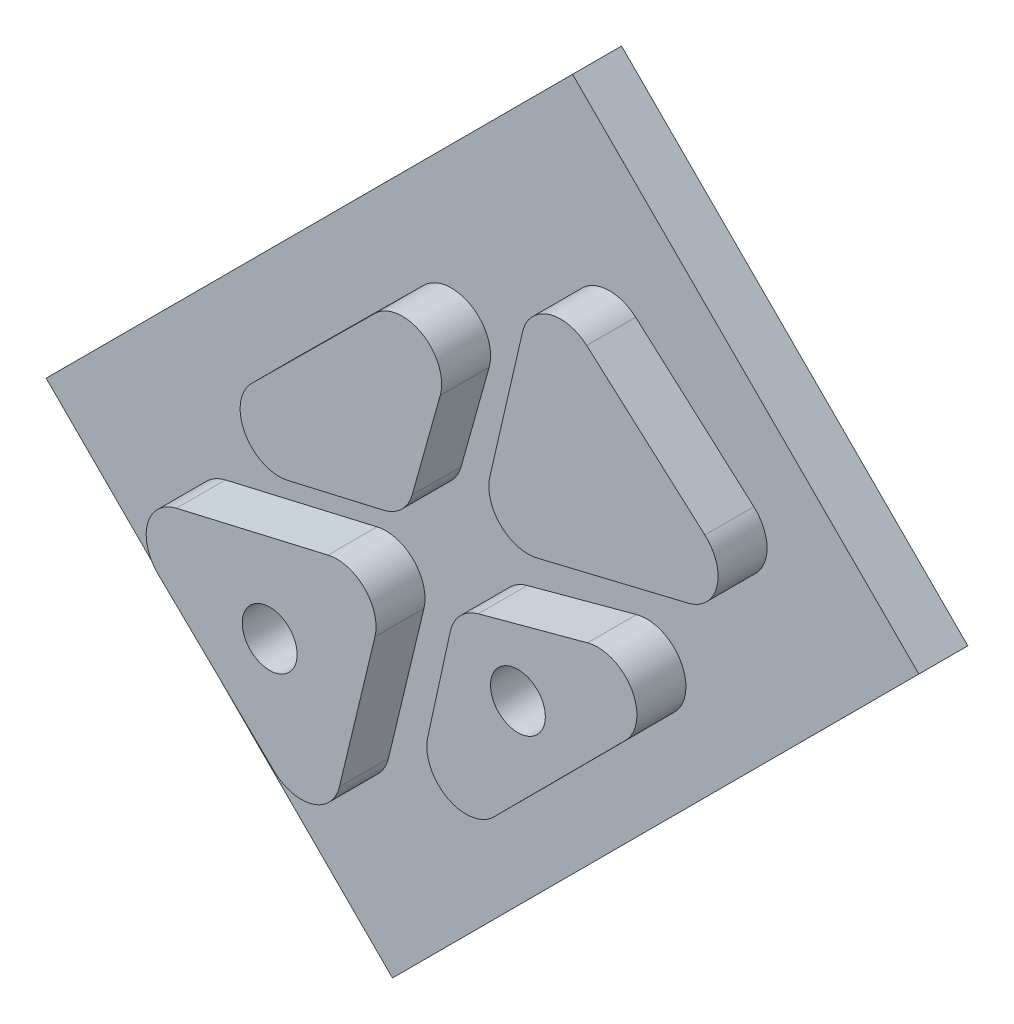
ISO-10303-21;
HEADER;
FILE_DESCRIPTION(('STEP AP214'),'2;1');
FILE_NAME('part.step','',(''),(''),'','','');
FILE_SCHEMA(('AUTOMOTIVE_DESIGN { 1 0 10303 214 1 1 1 1 }'));
ENDSEC;
DATA;
#1=APPLICATION_CONTEXT('core data for automotive mechanical design processes');
#2=APPLICATION_PROTOCOL_DEFINITION('international standard','automotive_design',2000,#1);
#3=PRODUCT_CONTEXT('',#1,'mechanical');
#4=PRODUCT('Part','Part','',(#3));
#5=PRODUCT_RELATED_PRODUCT_CATEGORY('part','',(#4));
#6=PRODUCT_DEFINITION_FORMATION('','',#4);
#7=PRODUCT_DEFINITION_CONTEXT('part definition',#1,'design');
#8=PRODUCT_DEFINITION('design','',#6,#7);
#9=PRODUCT_DEFINITION_SHAPE('','',#8);
#10=(LENGTH_UNIT() NAMED_UNIT(*) SI_UNIT(.MILLI.,.METRE.));
#11=(NAMED_UNIT(*) PLANE_ANGLE_UNIT() SI_UNIT($,.RADIAN.));
#12=(NAMED_UNIT(*) SI_UNIT($,.STERADIAN.) SOLID_ANGLE_UNIT());
#13=UNCERTAINTY_MEASURE_WITH_UNIT(LENGTH_MEASURE(1.E-05),#10,'distance_accuracy_value','');
#14=(GEOMETRIC_REPRESENTATION_CONTEXT(3) GLOBAL_UNCERTAINTY_ASSIGNED_CONTEXT((#13)) GLOBAL_UNIT_ASSIGNED_CONTEXT((#10,
#11,#12)) REPRESENTATION_CONTEXT('',''));
#15=CARTESIAN_POINT('',(0.,0.,0.));
#16=DIRECTION('',(0.,0.,1.));
#17=DIRECTION('',(1.,0.,0.));
#18=AXIS2_PLACEMENT_3D('',#15,#16,#17);
#19=CARTESIAN_POINT('',(232.187566849843,-300.437513369969,6.35));
#20=DIRECTION('',(0.707106781186548,0.707106781186547,0.));
#21=DIRECTION('',(-0.707106781186547,0.707106781186548,0.));
#22=AXIS2_PLACEMENT_3D('',#19,#20,#21);
#23=PLANE('',#22);
#24=DIRECTION('',(0.707106781186547,-0.707106781186548,0.));
#25=VECTOR('',#24,1.);
#26=CARTESIAN_POINT('',(232.187566849843,-300.437513369969,0.));
#27=LINE('',#26,#25);
#28=CARTESIAN_POINT('',(187.286286244497,-255.536232764624,0.));
#29=VERTEX_POINT('',#28);
#30=CARTESIAN_POINT('',(232.187566849843,-300.437513369969,0.));
#31=VERTEX_POINT('',#30);
#32=EDGE_CURVE('E359',#29,#31,#27,.T.);
#33=ORIENTED_EDGE('',*,*,#32,.T.);
#34=DIRECTION('',(0.,0.,-1.));
#35=VECTOR('',#34,1.);
#36=CARTESIAN_POINT('',(232.187566849843,-300.437513369969,6.35));
#37=LINE('',#36,#35);
#38=CARTESIAN_POINT('',(232.187566849843,-300.437513369969,6.35));
#39=VERTEX_POINT('',#38);
#40=EDGE_CURVE('E340',#39,#31,#37,.T.);
#41=ORIENTED_EDGE('',*,*,#40,.F.);
#42=DIRECTION('',(0.707106781186547,-0.707106781186548,0.));
#43=VECTOR('',#42,1.);
#44=CARTESIAN_POINT('',(232.187566849843,-300.437513369969,6.35));
#45=LINE('',#44,#43);
#46=CARTESIAN_POINT('',(187.286286244497,-255.536232764624,6.35));
#47=VERTEX_POINT('',#46);
#48=EDGE_CURVE('E347',#47,#39,#45,.T.);
#49=ORIENTED_EDGE('',*,*,#48,.F.);
#50=DIRECTION('',(0.,0.,-1.));
#51=VECTOR('',#50,1.);
#52=CARTESIAN_POINT('',(187.286286244497,-255.536232764624,6.35));
#53=LINE('',#52,#51);
#54=EDGE_CURVE('E554',#47,#29,#53,.T.);
#55=ORIENTED_EDGE('',*,*,#54,.T.);
#56=EDGE_LOOP('',(#33,#41,#49,#55));
#57=FACE_BOUND('',#56,.T.);
#58=ADVANCED_FACE('F150',(#57),#23,.F.);
#59=CARTESIAN_POINT('',(300.437513369968,-232.187566849844,6.35));
#60=DIRECTION('',(-0.707106781186548,0.707106781186548,0.));
#61=DIRECTION('',(-0.707106781186548,-0.707106781186548,0.));
#62=AXIS2_PLACEMENT_3D('',#59,#60,#61);
#63=PLANE('',#62);
#64=DIRECTION('',(0.707106781186547,0.707106781186547,0.));
#65=VECTOR('',#64,1.);
#66=CARTESIAN_POINT('',(300.437513369968,-232.187566849844,0.));
#67=LINE('',#66,#65);
#68=CARTESIAN_POINT('',(300.437513369968,-232.187566849844,0.));
#69=VERTEX_POINT('',#68);
#70=EDGE_CURVE('E556',#31,#69,#67,.T.);
#71=ORIENTED_EDGE('',*,*,#70,.T.);
#72=DIRECTION('',(0.,0.,-1.));
#73=VECTOR('',#72,1.);
#74=CARTESIAN_POINT('',(300.437513369968,-232.187566849844,6.35));
#75=LINE('',#74,#73);
#76=CARTESIAN_POINT('',(300.437513369968,-232.187566849844,6.35));
#77=VERTEX_POINT('',#76);
#78=EDGE_CURVE('E343',#77,#69,#75,.T.);
#79=ORIENTED_EDGE('',*,*,#78,.F.);
#80=DIRECTION('',(0.707106781186547,0.707106781186547,0.));
#81=VECTOR('',#80,1.);
#82=CARTESIAN_POINT('',(300.437513369968,-232.187566849844,6.35));
#83=LINE('',#82,#81);
#84=EDGE_CURVE('E336',#39,#77,#83,.T.);
#85=ORIENTED_EDGE('',*,*,#84,.F.);
#86=ORIENTED_EDGE('',*,*,#40,.T.);
#87=EDGE_LOOP('',(#71,#79,#85,#86));
#88=FACE_BOUND('',#87,.T.);
#89=ADVANCED_FACE('F338',(#88),#63,.F.);
#90=CARTESIAN_POINT('',(255.536232764623,-187.286286244498,6.35));
#91=DIRECTION('',(-0.707106781186547,-0.707106781186548,0.));
#92=DIRECTION('',(0.707106781186548,-0.707106781186547,0.));
#93=AXIS2_PLACEMENT_3D('',#90,#91,#92);
#94=PLANE('',#93);
#95=DIRECTION('',(-0.707106781186548,0.707106781186547,0.));
#96=VECTOR('',#95,1.);
#97=CARTESIAN_POINT('',(255.536232764623,-187.286286244498,0.));
#98=LINE('',#97,#96);
#99=CARTESIAN_POINT('',(255.536232764623,-187.286286244498,0.));
#100=VERTEX_POINT('',#99);
#101=EDGE_CURVE('E558',#69,#100,#98,.T.);
#102=ORIENTED_EDGE('',*,*,#101,.T.);
#103=DIRECTION('',(0.,0.,-1.));
#104=VECTOR('',#103,1.);
#105=CARTESIAN_POINT('',(255.536232764623,-187.286286244498,6.35));
#106=LINE('',#105,#104);
#107=CARTESIAN_POINT('',(255.536232764623,-187.286286244498,6.35));
#108=VERTEX_POINT('',#107);
#109=EDGE_CURVE('E364',#108,#100,#106,.T.);
#110=ORIENTED_EDGE('',*,*,#109,.F.);
#111=DIRECTION('',(-0.707106781186548,0.707106781186547,0.));
#112=VECTOR('',#111,1.);
#113=CARTESIAN_POINT('',(255.536232764623,-187.286286244498,6.35));
#114=LINE('',#113,#112);
#115=EDGE_CURVE('E346',#77,#108,#114,.T.);
#116=ORIENTED_EDGE('',*,*,#115,.F.);
#117=ORIENTED_EDGE('',*,*,#78,.T.);
#118=EDGE_LOOP('',(#102,#110,#116,#117));
#119=FACE_BOUND('',#118,.T.);
#120=ADVANCED_FACE('F570',(#119),#94,.F.);
#121=CARTESIAN_POINT('',(187.286286244497,-255.536232764624,6.35));
#122=DIRECTION('',(0.707106781186548,-0.707106781186548,0.));
#123=DIRECTION('',(0.707106781186548,0.707106781186548,0.));
#124=AXIS2_PLACEMENT_3D('',#121,#122,#123);
#125=PLANE('',#124);
#126=DIRECTION('',(-0.707106781186547,-0.707106781186547,0.));
#127=VECTOR('',#126,1.);
#128=CARTESIAN_POINT('',(187.286286244497,-255.536232764624,0.));
#129=LINE('',#128,#127);
#130=EDGE_CURVE('E356',#100,#29,#129,.T.);
#131=ORIENTED_EDGE('',*,*,#130,.T.);
#132=ORIENTED_EDGE('',*,*,#54,.F.);
#133=DIRECTION('',(-0.707106781186547,-0.707106781186547,0.));
#134=VECTOR('',#133,1.);
#135=CARTESIAN_POINT('',(187.286286244497,-255.536232764624,6.35));
#136=LINE('',#135,#134);
#137=EDGE_CURVE('E352',#108,#47,#136,.T.);
#138=ORIENTED_EDGE('',*,*,#137,.F.);
#139=ORIENTED_EDGE('',*,*,#109,.T.);
#140=EDGE_LOOP('',(#131,#132,#138,#139));
#141=FACE_BOUND('',#140,.T.);
#142=ADVANCED_FACE('F565',(#141),#125,.F.);
#143=CARTESIAN_POINT('',(0.,0.,6.35));
#144=DIRECTION('',(0.,0.,-1.));
#145=DIRECTION('',(-1.,0.,0.));
#146=AXIS2_PLACEMENT_3D('',#143,#144,#145);
#147=PLANE('',#146);
#148=DIRECTION('',(0.710263211480383,0.703936197689516,0.));
#149=VECTOR('',#148,1.);
#150=CARTESIAN_POINT('',(227.372114401296,-229.415746350039,6.35));
#151=LINE('',#150,#149);
#152=CARTESIAN_POINT('',(220.290147249652,-236.43462744695,6.35));
#153=VERTEX_POINT('',#152);
#154=CARTESIAN_POINT('',(236.257974943894,-220.609040916826,6.35));
#155=VERTEX_POINT('',#154);
#156=EDGE_CURVE('E495',#153,#155,#151,.T.);
#157=ORIENTED_EDGE('',*,*,#156,.T.);
#158=CARTESIAN_POINT('',(239.833970828157,-224.217178031146,6.35));
#159=DIRECTION('',(0.,0.,-1.));
#160=DIRECTION('',(-1.,0.,0.));
#161=AXIS2_PLACEMENT_3D('',#158,#159,#160);
#162=CIRCLE('',#161,5.08);
#163=CARTESIAN_POINT('',(244.725964113775,-225.586412011687,6.35));
#164=VERTEX_POINT('',#163);
#165=EDGE_CURVE('E450',#155,#164,#162,.T.);
#166=ORIENTED_EDGE('',*,*,#165,.T.);
#167=DIRECTION('',(-0.269534248137939,-0.962990804255532,0.));
#168=VECTOR('',#167,1.);
#169=CARTESIAN_POINT('',(285.499922346645,-79.9093891375555,6.35));
#170=LINE('',#169,#168);
#171=CARTESIAN_POINT('',(241.092359992385,-238.56853721239,6.35));
#172=VERTEX_POINT('',#171);
#173=EDGE_CURVE('E474',#164,#172,#170,.T.);
#174=ORIENTED_EDGE('',*,*,#173,.T.);
#175=CARTESIAN_POINT('',(236.200366706767,-237.199303231849,6.35));
#176=DIRECTION('',(0.,0.,-1.));
#177=DIRECTION('',(-1.,0.,0.));
#178=AXIS2_PLACEMENT_3D('',#175,#176,#177);
#179=CIRCLE('',#178,5.08);
#180=CARTESIAN_POINT('',(237.341548725504,-242.149465209008,6.35));
#181=VERTEX_POINT('',#180);
#182=EDGE_CURVE('E12',#172,#181,#179,.T.);
#183=ORIENTED_EDGE('',*,*,#182,.T.);
#184=DIRECTION('',(0.974441334086424,0.224642129672663,0.));
#185=VECTOR('',#184,1.);
#186=CARTESIAN_POINT('',(64.9838819676013,-281.883815519801,6.35));
#187=LINE('',#186,#185);
#188=CARTESIAN_POINT('',(225.007325152651,-244.992926538429,6.35));
#189=VERTEX_POINT('',#188);
#190=EDGE_CURVE('E487',#189,#181,#187,.T.);
#191=ORIENTED_EDGE('',*,*,#190,.F.);
#192=CARTESIAN_POINT('',(223.866143133914,-240.04276456127,6.35));
#193=DIRECTION('',(0.,0.,-1.));
#194=DIRECTION('',(-1.,0.,0.));
#195=AXIS2_PLACEMENT_3D('',#192,#193,#194);
#196=CIRCLE('',#195,5.08);
#197=EDGE_CURVE('E159',#189,#153,#196,.T.);
#198=ORIENTED_EDGE('',*,*,#197,.T.);
#199=EDGE_LOOP('',(#157,#166,#174,#183,#191,#198));
#200=FACE_BOUND('',#199,.T.);
#201=DIRECTION('',(-0.224752967151728,-0.974415775609413,0.));
#202=VECTOR('',#201,1.);
#203=CARTESIAN_POINT('',(289.171164271793,-66.6985067479623,6.35));
#204=LINE('',#203,#202);
#205=CARTESIAN_POINT('',(255.395669608826,-213.132056639157,6.35));
#206=VERTEX_POINT('',#205);
#207=CARTESIAN_POINT('',(251.165866137332,-231.470356162336,6.35));
#208=VERTEX_POINT('',#207);
#209=EDGE_CURVE('E493',#206,#208,#204,.T.);
#210=ORIENTED_EDGE('',*,*,#209,.F.);
#211=CARTESIAN_POINT('',(260.345701748922,-214.273801712288,6.35));
#212=DIRECTION('',(0.,0.,-1.));
#213=DIRECTION('',(-1.,0.,0.));
#214=AXIS2_PLACEMENT_3D('',#211,#212,#213);
#215=CIRCLE('',#214,5.08);
#216=CARTESIAN_POINT('',(263.719766841166,-210.476159713192,6.35));
#217=VERTEX_POINT('',#216);
#218=EDGE_CURVE('E452',#206,#217,#215,.T.);
#219=ORIENTED_EDGE('',*,*,#218,.T.);
#220=DIRECTION('',(-0.747567322656667,0.664186041780421,0.));
#221=VECTOR('',#220,1.);
#222=CARTESIAN_POINT('',(11.8317363423572,13.3170812143621,6.35));
#223=LINE('',#222,#221);
#224=CARTESIAN_POINT('',(279.046980021704,-224.093824297204,6.35));
#225=VERTEX_POINT('',#224);
#226=EDGE_CURVE('E503',#225,#217,#223,.T.);
#227=ORIENTED_EDGE('',*,*,#226,.F.);
#228=CARTESIAN_POINT('',(275.67291492946,-227.8914662963,6.35));
#229=DIRECTION('',(0.,0.,-1.));
#230=DIRECTION('',(-1.,0.,0.));
#231=AXIS2_PLACEMENT_3D('',#228,#229,#230);
#232=CIRCLE('',#231,5.08);
#233=CARTESIAN_POINT('',(276.864883050935,-232.829645312636,6.35));
#234=VERTEX_POINT('',#233);
#235=EDGE_CURVE('E454',#225,#234,#232,.T.);
#236=ORIENTED_EDGE('',*,*,#235,.T.);
#237=DIRECTION('',(-0.972082483530827,-0.234639393991159,0.));
#238=VECTOR('',#237,1.);
#239=CARTESIAN_POINT('',(68.3488196181154,-283.160850318602,6.35));
#240=LINE('',#239,#238);
#241=CARTESIAN_POINT('',(257.307866398902,-237.550280251803,6.35));
#242=VERTEX_POINT('',#241);
#243=EDGE_CURVE('E512',#234,#242,#240,.T.);
#244=ORIENTED_EDGE('',*,*,#243,.T.);
#245=CARTESIAN_POINT('',(256.115898277427,-232.612101235466,6.35));
#246=DIRECTION('',(0.,0.,-1.));
#247=DIRECTION('',(-1.,0.,0.));
#248=AXIS2_PLACEMENT_3D('',#245,#246,#247);
#249=CIRCLE('',#248,5.08);
#250=EDGE_CURVE('E456',#242,#208,#249,.T.);
#251=ORIENTED_EDGE('',*,*,#250,.T.);
#252=EDGE_LOOP('',(#210,#219,#227,#236,#244,#251));
#253=FACE_BOUND('',#252,.T.);
#254=DIRECTION('',(-0.965499786849266,-0.260403843278134,0.));
#255=VECTOR('',#254,1.);
#256=CARTESIAN_POINT('',(79.1879448605753,-293.605282170338,6.35));
#257=LINE('',#256,#255);
#258=CARTESIAN_POINT('',(263.831735427411,-243.805216591915,6.35));
#259=VERTEX_POINT('',#258);
#260=CARTESIAN_POINT('',(249.667472252146,-247.625443813382,6.35));
#261=VERTEX_POINT('',#260);
#262=EDGE_CURVE('E530',#259,#261,#257,.T.);
#263=ORIENTED_EDGE('',*,*,#262,.F.);
#264=CARTESIAN_POINT('',(265.154586951264,-248.709955509109,6.35));
#265=DIRECTION('',(0.,0.,-1.));
#266=DIRECTION('',(-1.,0.,0.));
#267=AXIS2_PLACEMENT_3D('',#264,#265,#266);
#268=CIRCLE('',#267,5.08);
#269=CARTESIAN_POINT('',(268.752446691008,-252.296291423818,6.35));
#270=VERTEX_POINT('',#269);
#271=EDGE_CURVE('E462',#259,#270,#268,.T.);
#272=ORIENTED_EDGE('',*,*,#271,.T.);
#273=DIRECTION('',(-0.705971636753682,-0.708240106248811,0.));
#274=VECTOR('',#273,1.);
#275=CARTESIAN_POINT('',(260.954811756181,-260.118982176843,6.35));
#276=LINE('',#275,#274);
#277=CARTESIAN_POINT('',(251.672172778169,-269.431448675197,6.35));
#278=VERTEX_POINT('',#277);
#279=EDGE_CURVE('E509',#270,#278,#276,.T.);
#280=ORIENTED_EDGE('',*,*,#279,.T.);
#281=CARTESIAN_POINT('',(248.074313038425,-265.845112760488,6.35));
#282=DIRECTION('',(0.,0.,-1.));
#283=DIRECTION('',(-1.,0.,0.));
#284=AXIS2_PLACEMENT_3D('',#281,#282,#283);
#285=CIRCLE('',#284,5.08);
#286=CARTESIAN_POINT('',(243.111923277208,-264.758334099599,6.35));
#287=VERTEX_POINT('',#286);
#288=EDGE_CURVE('E458',#278,#287,#285,.T.);
#289=ORIENTED_EDGE('',*,*,#288,.T.);
#290=DIRECTION('',(0.213932807261593,0.976848378192427,0.));
#291=VECTOR('',#290,1.);
#292=CARTESIAN_POINT('',(287.314534445121,-62.922769073579,6.35));
#293=LINE('',#292,#291);
#294=CARTESIAN_POINT('',(246.027934014782,-251.443404069687,6.35));
#295=VERTEX_POINT('',#294);
#296=EDGE_CURVE('E521',#287,#295,#293,.T.);
#297=ORIENTED_EDGE('',*,*,#296,.T.);
#298=CARTESIAN_POINT('',(250.990323775999,-252.530182730576,6.35));
#299=DIRECTION('',(0.,0.,-1.));
#300=DIRECTION('',(-1.,0.,0.));
#301=AXIS2_PLACEMENT_3D('',#298,#299,#300);
#302=CIRCLE('',#301,5.08);
#303=EDGE_CURVE('E460',#295,#261,#302,.T.);
#304=ORIENTED_EDGE('',*,*,#303,.T.);
#305=EDGE_LOOP('',(#263,#272,#280,#289,#297,#304));
#306=FACE_BOUND('',#305,.T.);
#307=DIRECTION('',(0.23388239234324,0.972264895258387,0.));
#308=VECTOR('',#307,1.);
#309=CARTESIAN_POINT('',(281.762119879167,-67.7790579403044,6.35));
#310=LINE('',#309,#308);
#311=CARTESIAN_POINT('',(231.659356999546,-276.059625858474,6.35));
#312=VERTEX_POINT('',#311);
#313=CARTESIAN_POINT('',(236.264486741984,-256.915790609383,6.35));
#314=VERTEX_POINT('',#313);
#315=EDGE_CURVE('E539',#312,#314,#310,.T.);
#316=ORIENTED_EDGE('',*,*,#315,.F.);
#317=CARTESIAN_POINT('',(226.720251331634,-274.87150330537,6.35));
#318=DIRECTION('',(0.,0.,-1.));
#319=DIRECTION('',(-1.,0.,0.));
#320=AXIS2_PLACEMENT_3D('',#317,#318,#319);
#321=CIRCLE('',#320,5.08);
#322=CARTESIAN_POINT('',(223.183710024922,-278.518320491071,6.35));
#323=VERTEX_POINT('',#322);
#324=EDGE_CURVE('E448',#312,#323,#321,.T.);
#325=ORIENTED_EDGE('',*,*,#324,.T.);
#326=DIRECTION('',(-0.717877398759971,0.696169548565303,0.));
#327=VECTOR('',#326,1.);
#328=CARTESIAN_POINT('',(-31.0270966092299,-31.9945786925194,6.35));
#329=LINE('',#328,#327);
#330=CARTESIAN_POINT('',(208.145499955316,-263.93484992427,6.35));
#331=VERTEX_POINT('',#330);
#332=EDGE_CURVE('E547',#323,#331,#329,.T.);
#333=ORIENTED_EDGE('',*,*,#332,.T.);
#334=CARTESIAN_POINT('',(211.682041262028,-260.288032738569,6.35));
#335=DIRECTION('',(0.,0.,-1.));
#336=DIRECTION('',(-1.,0.,0.));
#337=AXIS2_PLACEMENT_3D('',#334,#335,#336);
#338=CIRCLE('',#337,5.08);
#339=CARTESIAN_POINT('',(210.533229766815,-255.339635811435,6.35));
#340=VERTEX_POINT('',#339);
#341=EDGE_CURVE('E464',#331,#340,#338,.T.);
#342=ORIENTED_EDGE('',*,*,#341,.T.);
#343=DIRECTION('',(0.97409388329404,0.226143995120672,0.));
#344=VECTOR('',#343,1.);
#345=CARTESIAN_POINT('',(67.0145171796219,-288.658698373751,6.35));
#346=LINE('',#345,#344);
#347=CARTESIAN_POINT('',(230.176569578858,-250.779271129146,6.35));
#348=VERTEX_POINT('',#347);
#349=EDGE_CURVE('E527',#340,#348,#346,.T.);
#350=ORIENTED_EDGE('',*,*,#349,.T.);
#351=CARTESIAN_POINT('',(231.325381074071,-255.727668056279,6.35));
#352=DIRECTION('',(0.,0.,-1.));
#353=DIRECTION('',(-1.,0.,0.));
#354=AXIS2_PLACEMENT_3D('',#351,#352,#353);
#355=CIRCLE('',#354,5.08);
#356=EDGE_CURVE('E466',#348,#314,#355,.T.);
#357=ORIENTED_EDGE('',*,*,#356,.T.);
#358=EDGE_LOOP('',(#316,#325,#333,#342,#350,#357));
#359=FACE_BOUND('',#358,.T.);
#360=ORIENTED_EDGE('',*,*,#48,.T.);
#361=ORIENTED_EDGE('',*,*,#84,.T.);
#362=ORIENTED_EDGE('',*,*,#115,.T.);
#363=ORIENTED_EDGE('',*,*,#137,.T.);
#364=EDGE_LOOP('',(#360,#361,#362,#363));
#365=FACE_BOUND('',#364,.T.);
#366=ADVANCED_FACE('F350',(#200,#253,#306,#359,#365),#147,.F.);
#367=CARTESIAN_POINT('',(0.,0.,0.));
#368=DIRECTION('',(0.,0.,-1.));
#369=DIRECTION('',(-1.,0.,0.));
#370=AXIS2_PLACEMENT_3D('',#367,#368,#369);
#371=PLANE('',#370);
#372=CARTESIAN_POINT('',(254.802658361721,-254.853889616723,0.));
#373=DIRECTION('',(0.,0.,1.));
#374=DIRECTION('',(1.,0.,0.));
#375=AXIS2_PLACEMENT_3D('',#372,#373,#374);
#376=CIRCLE('',#375,3.55600000000001);
#377=CARTESIAN_POINT('',(258.358658361721,-254.853889616723,0.));
#378=VERTEX_POINT('',#377);
#379=EDGE_CURVE('E470',#378,#378,#376,.T.);
#380=ORIENTED_EDGE('',*,*,#379,.T.);
#381=EDGE_LOOP('',(#380));
#382=FACE_BOUND('',#381,.T.);
#383=CARTESIAN_POINT('',(222.616120289038,-263.954699999894,0.));
#384=DIRECTION('',(0.,0.,1.));
#385=DIRECTION('',(1.,0.,0.));
#386=AXIS2_PLACEMENT_3D('',#383,#384,#385);
#387=CIRCLE('',#386,3.55600000000001);
#388=CARTESIAN_POINT('',(226.172120289038,-263.954699999894,0.));
#389=VERTEX_POINT('',#388);
#390=EDGE_CURVE('E476',#389,#389,#387,.T.);
#391=ORIENTED_EDGE('',*,*,#390,.T.);
#392=EDGE_LOOP('',(#391));
#393=FACE_BOUND('',#392,.T.);
#394=ORIENTED_EDGE('',*,*,#32,.F.);
#395=ORIENTED_EDGE('',*,*,#130,.F.);
#396=ORIENTED_EDGE('',*,*,#101,.F.);
#397=ORIENTED_EDGE('',*,*,#70,.F.);
#398=EDGE_LOOP('',(#394,#395,#396,#397));
#399=FACE_BOUND('',#398,.T.);
#400=ADVANCED_FACE('F569',(#382,#393,#399),#371,.T.);
#401=CARTESIAN_POINT('',(67.0145171796219,-288.658698373751,12.7));
#402=DIRECTION('',(-0.226143995120672,0.974093883294039,0.));
#403=DIRECTION('',(-0.97409388329404,-0.226143995120672,0.));
#404=AXIS2_PLACEMENT_3D('',#401,#402,#403);
#405=PLANE('',#404);
#406=ORIENTED_EDGE('',*,*,#349,.F.);
#407=DIRECTION('',(0.,0.,-1.));
#408=VECTOR('',#407,1.);
#409=CARTESIAN_POINT('',(210.533229766815,-255.339635811435,12.7));
#410=LINE('',#409,#408);
#411=CARTESIAN_POINT('',(210.533229766815,-255.339635811435,12.7));
#412=VERTEX_POINT('',#411);
#413=EDGE_CURVE('E442',#340,#412,#410,.F.);
#414=ORIENTED_EDGE('',*,*,#413,.T.);
#415=DIRECTION('',(0.97409388329404,0.226143995120672,0.));
#416=VECTOR('',#415,1.);
#417=CARTESIAN_POINT('',(67.0145171796219,-288.658698373751,12.7));
#418=LINE('',#417,#416);
#419=CARTESIAN_POINT('',(230.176569578858,-250.779271129146,12.7));
#420=VERTEX_POINT('',#419);
#421=EDGE_CURVE('E535',#412,#420,#418,.T.);
#422=ORIENTED_EDGE('',*,*,#421,.T.);
#423=DIRECTION('',(0.,0.,-1.));
#424=VECTOR('',#423,1.);
#425=CARTESIAN_POINT('',(230.176569578858,-250.779271129146,6.35));
#426=LINE('',#425,#424);
#427=EDGE_CURVE('E439',#420,#348,#426,.T.);
#428=ORIENTED_EDGE('',*,*,#427,.T.);
#429=EDGE_LOOP('',(#406,#414,#422,#428));
#430=FACE_BOUND('',#429,.T.);
#431=ADVANCED_FACE('F673',(#430),#405,.T.);
#432=CARTESIAN_POINT('',(-31.0270966092299,-31.9945786925194,12.7));
#433=DIRECTION('',(-0.696169548565302,-0.717877398759971,0.));
#434=DIRECTION('',(0.717877398759971,-0.696169548565302,0.));
#435=AXIS2_PLACEMENT_3D('',#432,#433,#434);
#436=PLANE('',#435);
#437=ORIENTED_EDGE('',*,*,#332,.F.);
#438=DIRECTION('',(0.,0.,-1.));
#439=VECTOR('',#438,1.);
#440=CARTESIAN_POINT('',(223.183710024922,-278.518320491071,12.7));
#441=LINE('',#440,#439);
#442=CARTESIAN_POINT('',(223.183710024922,-278.518320491071,12.7));
#443=VERTEX_POINT('',#442);
#444=EDGE_CURVE('E373',#323,#443,#441,.F.);
#445=ORIENTED_EDGE('',*,*,#444,.T.);
#446=DIRECTION('',(-0.717877398759971,0.696169548565303,0.));
#447=VECTOR('',#446,1.);
#448=CARTESIAN_POINT('',(-31.0270966092299,-31.9945786925194,12.7));
#449=LINE('',#448,#447);
#450=CARTESIAN_POINT('',(208.145499955316,-263.93484992427,12.7));
#451=VERTEX_POINT('',#450);
#452=EDGE_CURVE('E538',#443,#451,#449,.T.);
#453=ORIENTED_EDGE('',*,*,#452,.T.);
#454=DIRECTION('',(0.,0.,-1.));
#455=VECTOR('',#454,1.);
#456=CARTESIAN_POINT('',(208.145499955316,-263.93484992427,12.7));
#457=LINE('',#456,#455);
#458=EDGE_CURVE('E370',#451,#331,#457,.T.);
#459=ORIENTED_EDGE('',*,*,#458,.T.);
#460=EDGE_LOOP('',(#437,#445,#453,#459));
#461=FACE_BOUND('',#460,.T.);
#462=ADVANCED_FACE('F678',(#461),#436,.T.);
#463=CARTESIAN_POINT('',(281.762119879167,-67.7790579403044,12.7));
#464=DIRECTION('',(-0.972264895258387,0.23388239234324,0.));
#465=DIRECTION('',(-0.23388239234324,-0.972264895258387,0.));
#466=AXIS2_PLACEMENT_3D('',#463,#464,#465);
#467=PLANE('',#466);
#468=DIRECTION('',(0.23388239234324,0.972264895258387,0.));
#469=VECTOR('',#468,1.);
#470=CARTESIAN_POINT('',(281.762119879167,-67.7790579403044,12.7));
#471=LINE('',#470,#469);
#472=CARTESIAN_POINT('',(231.659356999546,-276.059625858474,12.7));
#473=VERTEX_POINT('',#472);
#474=CARTESIAN_POINT('',(236.264486741984,-256.915790609383,12.7));
#475=VERTEX_POINT('',#474);
#476=EDGE_CURVE('E542',#473,#475,#471,.T.);
#477=ORIENTED_EDGE('',*,*,#476,.F.);
#478=DIRECTION('',(0.,0.,-1.));
#479=VECTOR('',#478,1.);
#480=CARTESIAN_POINT('',(231.659356999546,-276.059625858474,6.35));
#481=LINE('',#480,#479);
#482=EDGE_CURVE('E362',#473,#312,#481,.T.);
#483=ORIENTED_EDGE('',*,*,#482,.T.);
#484=ORIENTED_EDGE('',*,*,#315,.T.);
#485=DIRECTION('',(0.,0.,-1.));
#486=VECTOR('',#485,1.);
#487=CARTESIAN_POINT('',(236.264486741984,-256.915790609383,12.7));
#488=LINE('',#487,#486);
#489=EDGE_CURVE('E360',#314,#475,#488,.F.);
#490=ORIENTED_EDGE('',*,*,#489,.T.);
#491=EDGE_LOOP('',(#477,#483,#484,#490));
#492=FACE_BOUND('',#491,.T.);
#493=ADVANCED_FACE('F662',(#492),#467,.F.);
#494=CARTESIAN_POINT('',(0.,0.,12.7));
#495=DIRECTION('',(0.,0.,1.));
#496=DIRECTION('',(1.,0.,0.));
#497=AXIS2_PLACEMENT_3D('',#494,#495,#496);
#498=PLANE('',#497);
#499=CARTESIAN_POINT('',(222.616120289038,-263.954699999894,12.7));
#500=DIRECTION('',(0.,0.,1.));
#501=DIRECTION('',(1.,0.,0.));
#502=AXIS2_PLACEMENT_3D('',#499,#500,#501);
#503=CIRCLE('',#502,3.55600000000001);
#504=CARTESIAN_POINT('',(226.172120289038,-263.954699999894,12.7));
#505=VERTEX_POINT('',#504);
#506=EDGE_CURVE('E154',#505,#505,#503,.T.);
#507=ORIENTED_EDGE('',*,*,#506,.F.);
#508=EDGE_LOOP('',(#507));
#509=FACE_BOUND('',#508,.T.);
#510=ORIENTED_EDGE('',*,*,#452,.F.);
#511=CARTESIAN_POINT('',(226.720251331634,-274.87150330537,12.7));
#512=DIRECTION('',(0.,0.,1.));
#513=DIRECTION('',(1.,0.,0.));
#514=AXIS2_PLACEMENT_3D('',#511,#512,#513);
#515=CIRCLE('',#514,5.08);
#516=EDGE_CURVE('E379',#443,#473,#515,.T.);
#517=ORIENTED_EDGE('',*,*,#516,.T.);
#518=ORIENTED_EDGE('',*,*,#476,.T.);
#519=CARTESIAN_POINT('',(231.325381074071,-255.727668056279,12.7));
#520=DIRECTION('',(0.,0.,1.));
#521=DIRECTION('',(1.,0.,0.));
#522=AXIS2_PLACEMENT_3D('',#519,#520,#521);
#523=CIRCLE('',#522,5.08);
#524=EDGE_CURVE('E375',#475,#420,#523,.T.);
#525=ORIENTED_EDGE('',*,*,#524,.T.);
#526=ORIENTED_EDGE('',*,*,#421,.F.);
#527=CARTESIAN_POINT('',(211.682041262028,-260.288032738569,12.7));
#528=DIRECTION('',(0.,0.,1.));
#529=DIRECTION('',(1.,0.,0.));
#530=AXIS2_PLACEMENT_3D('',#527,#528,#529);
#531=CIRCLE('',#530,5.08);
#532=EDGE_CURVE('E377',#412,#451,#531,.T.);
#533=ORIENTED_EDGE('',*,*,#532,.T.);
#534=EDGE_LOOP('',(#510,#517,#518,#525,#526,#533));
#535=FACE_BOUND('',#534,.T.);
#536=ADVANCED_FACE('F669',(#509,#535),#498,.T.);
#537=CARTESIAN_POINT('',(260.954811756181,-260.118982176843,12.7));
#538=DIRECTION('',(0.708240106248811,-0.705971636753682,0.));
#539=DIRECTION('',(0.705971636753682,0.708240106248811,0.));
#540=AXIS2_PLACEMENT_3D('',#537,#538,#539);
#541=PLANE('',#540);
#542=DIRECTION('',(-0.705971636753682,-0.708240106248811,0.));
#543=VECTOR('',#542,1.);
#544=CARTESIAN_POINT('',(260.954811756181,-260.118982176843,12.7));
#545=LINE('',#544,#543);
#546=CARTESIAN_POINT('',(268.752446691008,-252.296291423818,12.7));
#547=VERTEX_POINT('',#546);
#548=CARTESIAN_POINT('',(251.672172778169,-269.431448675197,12.7));
#549=VERTEX_POINT('',#548);
#550=EDGE_CURVE('E517',#547,#549,#545,.T.);
#551=ORIENTED_EDGE('',*,*,#550,.T.);
#552=DIRECTION('',(0.,0.,-1.));
#553=VECTOR('',#552,1.);
#554=CARTESIAN_POINT('',(251.672172778169,-269.431448675197,12.7));
#555=LINE('',#554,#553);
#556=EDGE_CURVE('E420',#549,#278,#555,.T.);
#557=ORIENTED_EDGE('',*,*,#556,.T.);
#558=ORIENTED_EDGE('',*,*,#279,.F.);
#559=DIRECTION('',(0.,0.,-1.));
#560=VECTOR('',#559,1.);
#561=CARTESIAN_POINT('',(268.752446691008,-252.296291423818,12.7));
#562=LINE('',#561,#560);
#563=EDGE_CURVE('E418',#270,#547,#562,.F.);
#564=ORIENTED_EDGE('',*,*,#563,.T.);
#565=EDGE_LOOP('',(#551,#557,#558,#564));
#566=FACE_BOUND('',#565,.T.);
#567=ADVANCED_FACE('F740',(#566),#541,.T.);
#568=CARTESIAN_POINT('',(79.1879448605753,-293.605282170338,12.7));
#569=DIRECTION('',(0.260403843278133,-0.965499786849266,0.));
#570=DIRECTION('',(0.965499786849266,0.260403843278134,0.));
#571=AXIS2_PLACEMENT_3D('',#568,#569,#570);
#572=PLANE('',#571);
#573=ORIENTED_EDGE('',*,*,#262,.T.);
#574=DIRECTION('',(0.,0.,-1.));
#575=VECTOR('',#574,1.);
#576=CARTESIAN_POINT('',(249.667472252146,-247.625443813382,12.7));
#577=LINE('',#576,#575);
#578=CARTESIAN_POINT('',(249.667472252146,-247.625443813382,12.7));
#579=VERTEX_POINT('',#578);
#580=EDGE_CURVE('E437',#261,#579,#577,.F.);
#581=ORIENTED_EDGE('',*,*,#580,.T.);
#582=DIRECTION('',(-0.965499786849266,-0.260403843278134,0.));
#583=VECTOR('',#582,1.);
#584=CARTESIAN_POINT('',(79.1879448605753,-293.605282170338,12.7));
#585=LINE('',#584,#583);
#586=CARTESIAN_POINT('',(263.831735427411,-243.805216591915,12.7));
#587=VERTEX_POINT('',#586);
#588=EDGE_CURVE('E520',#587,#579,#585,.T.);
#589=ORIENTED_EDGE('',*,*,#588,.F.);
#590=DIRECTION('',(0.,0.,-1.));
#591=VECTOR('',#590,1.);
#592=CARTESIAN_POINT('',(263.831735427411,-243.805216591915,6.35));
#593=LINE('',#592,#591);
#594=EDGE_CURVE('E434',#587,#259,#593,.T.);
#595=ORIENTED_EDGE('',*,*,#594,.T.);
#596=EDGE_LOOP('',(#573,#581,#589,#595));
#597=FACE_BOUND('',#596,.T.);
#598=ADVANCED_FACE('F736',(#597),#572,.F.);
#599=CARTESIAN_POINT('',(287.314534445121,-62.922769073579,12.7));
#600=DIRECTION('',(-0.976848378192427,0.213932807261593,0.));
#601=DIRECTION('',(-0.213932807261593,-0.976848378192427,0.));
#602=AXIS2_PLACEMENT_3D('',#599,#600,#601);
#603=PLANE('',#602);
#604=ORIENTED_EDGE('',*,*,#296,.F.);
#605=DIRECTION('',(0.,0.,-1.));
#606=VECTOR('',#605,1.);
#607=CARTESIAN_POINT('',(243.111923277208,-264.758334099599,12.7));
#608=LINE('',#607,#606);
#609=CARTESIAN_POINT('',(243.111923277208,-264.758334099599,12.7));
#610=VERTEX_POINT('',#609);
#611=EDGE_CURVE('E426',#287,#610,#608,.F.);
#612=ORIENTED_EDGE('',*,*,#611,.T.);
#613=DIRECTION('',(0.213932807261593,0.976848378192427,0.));
#614=VECTOR('',#613,1.);
#615=CARTESIAN_POINT('',(287.314534445121,-62.922769073579,12.7));
#616=LINE('',#615,#614);
#617=CARTESIAN_POINT('',(246.027934014782,-251.443404069687,12.7));
#618=VERTEX_POINT('',#617);
#619=EDGE_CURVE('E524',#610,#618,#616,.T.);
#620=ORIENTED_EDGE('',*,*,#619,.T.);
#621=DIRECTION('',(0.,0.,-1.));
#622=VECTOR('',#621,1.);
#623=CARTESIAN_POINT('',(246.027934014782,-251.443404069687,6.35));
#624=LINE('',#623,#622);
#625=EDGE_CURVE('E423',#618,#295,#624,.T.);
#626=ORIENTED_EDGE('',*,*,#625,.T.);
#627=EDGE_LOOP('',(#604,#612,#620,#626));
#628=FACE_BOUND('',#627,.T.);
#629=ADVANCED_FACE('F732',(#628),#603,.T.);
#630=CARTESIAN_POINT('',(0.,0.,12.7));
#631=DIRECTION('',(0.,0.,1.));
#632=DIRECTION('',(1.,0.,0.));
#633=AXIS2_PLACEMENT_3D('',#630,#631,#632);
#634=PLANE('',#633);
#635=CARTESIAN_POINT('',(254.802658361721,-254.853889616723,12.7));
#636=DIRECTION('',(0.,0.,1.));
#637=DIRECTION('',(1.,0.,0.));
#638=AXIS2_PLACEMENT_3D('',#635,#636,#637);
#639=CIRCLE('',#638,3.55600000000001);
#640=CARTESIAN_POINT('',(258.358658361721,-254.853889616723,12.7));
#641=VERTEX_POINT('',#640);
#642=EDGE_CURVE('E468',#641,#641,#639,.T.);
#643=ORIENTED_EDGE('',*,*,#642,.F.);
#644=EDGE_LOOP('',(#643));
#645=FACE_BOUND('',#644,.T.);
#646=ORIENTED_EDGE('',*,*,#619,.F.);
#647=CARTESIAN_POINT('',(248.074313038425,-265.845112760488,12.7));
#648=DIRECTION('',(0.,0.,1.));
#649=DIRECTION('',(1.,0.,0.));
#650=AXIS2_PLACEMENT_3D('',#647,#648,#649);
#651=CIRCLE('',#650,5.08);
#652=EDGE_CURVE('E432',#610,#549,#651,.T.);
#653=ORIENTED_EDGE('',*,*,#652,.T.);
#654=ORIENTED_EDGE('',*,*,#550,.F.);
#655=CARTESIAN_POINT('',(265.154586951264,-248.709955509109,12.7));
#656=DIRECTION('',(0.,0.,1.));
#657=DIRECTION('',(1.,0.,0.));
#658=AXIS2_PLACEMENT_3D('',#655,#656,#657);
#659=CIRCLE('',#658,5.08);
#660=EDGE_CURVE('E428',#547,#587,#659,.T.);
#661=ORIENTED_EDGE('',*,*,#660,.T.);
#662=ORIENTED_EDGE('',*,*,#588,.T.);
#663=CARTESIAN_POINT('',(250.990323775999,-252.530182730576,12.7));
#664=DIRECTION('',(0.,0.,1.));
#665=DIRECTION('',(1.,0.,0.));
#666=AXIS2_PLACEMENT_3D('',#663,#664,#665);
#667=CIRCLE('',#666,5.08);
#668=EDGE_CURVE('E430',#579,#618,#667,.T.);
#669=ORIENTED_EDGE('',*,*,#668,.T.);
#670=EDGE_LOOP('',(#646,#653,#654,#661,#662,#669));
#671=FACE_BOUND('',#670,.T.);
#672=ADVANCED_FACE('F728',(#645,#671),#634,.T.);
#673=CARTESIAN_POINT('',(289.171164271793,-66.6985067479623,12.7));
#674=DIRECTION('',(0.974415775609413,-0.224752967151728,0.));
#675=DIRECTION('',(0.224752967151728,0.974415775609413,0.));
#676=AXIS2_PLACEMENT_3D('',#673,#674,#675);
#677=PLANE('',#676);
#678=DIRECTION('',(-0.224752967151728,-0.974415775609413,0.));
#679=VECTOR('',#678,1.);
#680=CARTESIAN_POINT('',(289.171164271793,-66.6985067479623,12.7));
#681=LINE('',#680,#679);
#682=CARTESIAN_POINT('',(255.395669608826,-213.132056639157,12.7));
#683=VERTEX_POINT('',#682);
#684=CARTESIAN_POINT('',(251.165866137332,-231.470356162336,12.7));
#685=VERTEX_POINT('',#684);
#686=EDGE_CURVE('E499',#683,#685,#681,.T.);
#687=ORIENTED_EDGE('',*,*,#686,.F.);
#688=DIRECTION('',(0.,0.,-1.));
#689=VECTOR('',#688,1.);
#690=CARTESIAN_POINT('',(255.395669608826,-213.132056639157,12.7));
#691=LINE('',#690,#689);
#692=EDGE_CURVE('E399',#683,#206,#691,.T.);
#693=ORIENTED_EDGE('',*,*,#692,.T.);
#694=ORIENTED_EDGE('',*,*,#209,.T.);
#695=DIRECTION('',(0.,0.,-1.));
#696=VECTOR('',#695,1.);
#697=CARTESIAN_POINT('',(251.165866137332,-231.470356162336,12.7));
#698=LINE('',#697,#696);
#699=EDGE_CURVE('E397',#208,#685,#698,.F.);
#700=ORIENTED_EDGE('',*,*,#699,.T.);
#701=EDGE_LOOP('',(#687,#693,#694,#700));
#702=FACE_BOUND('',#701,.T.);
#703=ADVANCED_FACE('F724',(#702),#677,.F.);
#704=CARTESIAN_POINT('',(68.3488196181154,-283.160850318602,12.7));
#705=DIRECTION('',(0.234639393991159,-0.972082483530827,0.));
#706=DIRECTION('',(0.972082483530827,0.234639393991159,0.));
#707=AXIS2_PLACEMENT_3D('',#704,#705,#706);
#708=PLANE('',#707);
#709=ORIENTED_EDGE('',*,*,#243,.F.);
#710=DIRECTION('',(0.,0.,-1.));
#711=VECTOR('',#710,1.);
#712=CARTESIAN_POINT('',(276.864883050935,-232.829645312636,12.7));
#713=LINE('',#712,#711);
#714=CARTESIAN_POINT('',(276.864883050935,-232.829645312636,12.7));
#715=VERTEX_POINT('',#714);
#716=EDGE_CURVE('E416',#234,#715,#713,.F.);
#717=ORIENTED_EDGE('',*,*,#716,.T.);
#718=DIRECTION('',(-0.972082483530827,-0.234639393991159,0.));
#719=VECTOR('',#718,1.);
#720=CARTESIAN_POINT('',(68.3488196181154,-283.160850318602,12.7));
#721=LINE('',#720,#719);
#722=CARTESIAN_POINT('',(257.307866398902,-237.550280251803,12.7));
#723=VERTEX_POINT('',#722);
#724=EDGE_CURVE('E502',#715,#723,#721,.T.);
#725=ORIENTED_EDGE('',*,*,#724,.T.);
#726=DIRECTION('',(0.,0.,-1.));
#727=VECTOR('',#726,1.);
#728=CARTESIAN_POINT('',(257.307866398902,-237.550280251803,6.35));
#729=LINE('',#728,#727);
#730=EDGE_CURVE('E413',#723,#242,#729,.T.);
#731=ORIENTED_EDGE('',*,*,#730,.T.);
#732=EDGE_LOOP('',(#709,#717,#725,#731));
#733=FACE_BOUND('',#732,.T.);
#734=ADVANCED_FACE('F720',(#733),#708,.T.);
#735=CARTESIAN_POINT('',(11.8317363423572,13.3170812143621,12.7));
#736=DIRECTION('',(-0.66418604178042,-0.747567322656667,0.));
#737=DIRECTION('',(0.747567322656667,-0.664186041780421,0.));
#738=AXIS2_PLACEMENT_3D('',#735,#736,#737);
#739=PLANE('',#738);
#740=ORIENTED_EDGE('',*,*,#226,.T.);
#741=DIRECTION('',(0.,0.,-1.));
#742=VECTOR('',#741,1.);
#743=CARTESIAN_POINT('',(263.719766841166,-210.476159713192,12.7));
#744=LINE('',#743,#742);
#745=CARTESIAN_POINT('',(263.719766841166,-210.476159713192,12.7));
#746=VERTEX_POINT('',#745);
#747=EDGE_CURVE('E405',#217,#746,#744,.F.);
#748=ORIENTED_EDGE('',*,*,#747,.T.);
#749=DIRECTION('',(-0.747567322656667,0.664186041780421,0.));
#750=VECTOR('',#749,1.);
#751=CARTESIAN_POINT('',(11.8317363423572,13.3170812143621,12.7));
#752=LINE('',#751,#750);
#753=CARTESIAN_POINT('',(279.046980021704,-224.093824297204,12.7));
#754=VERTEX_POINT('',#753);
#755=EDGE_CURVE('E506',#754,#746,#752,.T.);
#756=ORIENTED_EDGE('',*,*,#755,.F.);
#757=DIRECTION('',(0.,0.,-1.));
#758=VECTOR('',#757,1.);
#759=CARTESIAN_POINT('',(279.046980021704,-224.093824297204,6.35));
#760=LINE('',#759,#758);
#761=EDGE_CURVE('E402',#754,#225,#760,.T.);
#762=ORIENTED_EDGE('',*,*,#761,.T.);
#763=EDGE_LOOP('',(#740,#748,#756,#762));
#764=FACE_BOUND('',#763,.T.);
#765=ADVANCED_FACE('F716',(#764),#739,.F.);
#766=CARTESIAN_POINT('',(0.,0.,12.7));
#767=DIRECTION('',(0.,0.,1.));
#768=DIRECTION('',(1.,0.,0.));
#769=AXIS2_PLACEMENT_3D('',#766,#767,#768);
#770=PLANE('',#769);
#771=ORIENTED_EDGE('',*,*,#755,.T.);
#772=CARTESIAN_POINT('',(260.345701748922,-214.273801712288,12.7));
#773=DIRECTION('',(0.,0.,1.));
#774=DIRECTION('',(1.,0.,0.));
#775=AXIS2_PLACEMENT_3D('',#772,#773,#774);
#776=CIRCLE('',#775,5.08);
#777=EDGE_CURVE('E411',#746,#683,#776,.T.);
#778=ORIENTED_EDGE('',*,*,#777,.T.);
#779=ORIENTED_EDGE('',*,*,#686,.T.);
#780=CARTESIAN_POINT('',(256.115898277427,-232.612101235466,12.7));
#781=DIRECTION('',(0.,0.,1.));
#782=DIRECTION('',(1.,0.,0.));
#783=AXIS2_PLACEMENT_3D('',#780,#781,#782);
#784=CIRCLE('',#783,5.08);
#785=EDGE_CURVE('E407',#685,#723,#784,.T.);
#786=ORIENTED_EDGE('',*,*,#785,.T.);
#787=ORIENTED_EDGE('',*,*,#724,.F.);
#788=CARTESIAN_POINT('',(275.67291492946,-227.8914662963,12.7));
#789=DIRECTION('',(0.,0.,1.));
#790=DIRECTION('',(1.,0.,0.));
#791=AXIS2_PLACEMENT_3D('',#788,#789,#790);
#792=CIRCLE('',#791,5.08);
#793=EDGE_CURVE('E409',#715,#754,#792,.T.);
#794=ORIENTED_EDGE('',*,*,#793,.T.);
#795=EDGE_LOOP('',(#771,#778,#779,#786,#787,#794));
#796=FACE_BOUND('',#795,.T.);
#797=ADVANCED_FACE('F713',(#796),#770,.T.);
#798=CARTESIAN_POINT('',(285.499922346645,-79.9093891375555,12.7));
#799=DIRECTION('',(0.962990804255532,-0.269534248137939,0.));
#800=DIRECTION('',(0.269534248137939,0.962990804255532,0.));
#801=AXIS2_PLACEMENT_3D('',#798,#799,#800);
#802=PLANE('',#801);
#803=ORIENTED_EDGE('',*,*,#173,.F.);
#804=DIRECTION('',(0.,0.,-1.));
#805=VECTOR('',#804,1.);
#806=CARTESIAN_POINT('',(244.725964113775,-225.586412011687,12.7));
#807=LINE('',#806,#805);
#808=CARTESIAN_POINT('',(244.725964113775,-225.586412011687,12.7));
#809=VERTEX_POINT('',#808);
#810=EDGE_CURVE('E389',#164,#809,#807,.F.);
#811=ORIENTED_EDGE('',*,*,#810,.T.);
#812=DIRECTION('',(-0.269534248137939,-0.962990804255532,0.));
#813=VECTOR('',#812,1.);
#814=CARTESIAN_POINT('',(285.499922346645,-79.9093891375555,12.7));
#815=LINE('',#814,#813);
#816=CARTESIAN_POINT('',(241.092359992385,-238.56853721239,12.7));
#817=VERTEX_POINT('',#816);
#818=EDGE_CURVE('E483',#809,#817,#815,.T.);
#819=ORIENTED_EDGE('',*,*,#818,.T.);
#820=DIRECTION('',(0.,0.,-1.));
#821=VECTOR('',#820,1.);
#822=CARTESIAN_POINT('',(241.092359992385,-238.56853721239,6.35));
#823=LINE('',#822,#821);
#824=EDGE_CURVE('E386',#817,#172,#823,.T.);
#825=ORIENTED_EDGE('',*,*,#824,.T.);
#826=EDGE_LOOP('',(#803,#811,#819,#825));
#827=FACE_BOUND('',#826,.T.);
#828=ADVANCED_FACE('F644',(#827),#802,.T.);
#829=CARTESIAN_POINT('',(227.372114401296,-229.415746350039,12.7));
#830=DIRECTION('',(-0.703936197689516,0.710263211480382,0.));
#831=DIRECTION('',(-0.710263211480383,-0.703936197689516,0.));
#832=AXIS2_PLACEMENT_3D('',#829,#830,#831);
#833=PLANE('',#832);
#834=DIRECTION('',(0.710263211480383,0.703936197689516,0.));
#835=VECTOR('',#834,1.);
#836=CARTESIAN_POINT('',(227.372114401296,-229.415746350039,12.7));
#837=LINE('',#836,#835);
#838=CARTESIAN_POINT('',(220.290147249652,-236.43462744695,12.7));
#839=VERTEX_POINT('',#838);
#840=CARTESIAN_POINT('',(236.257974943894,-220.609040916826,12.7));
#841=VERTEX_POINT('',#840);
#842=EDGE_CURVE('E486',#839,#841,#837,.T.);
#843=ORIENTED_EDGE('',*,*,#842,.T.);
#844=DIRECTION('',(0.,0.,-1.));
#845=VECTOR('',#844,1.);
#846=CARTESIAN_POINT('',(236.257974943894,-220.609040916826,12.7));
#847=LINE('',#846,#845);
#848=EDGE_CURVE('E383',#841,#155,#847,.T.);
#849=ORIENTED_EDGE('',*,*,#848,.T.);
#850=ORIENTED_EDGE('',*,*,#156,.F.);
#851=DIRECTION('',(0.,0.,-1.));
#852=VECTOR('',#851,1.);
#853=CARTESIAN_POINT('',(220.290147249652,-236.43462744695,12.7));
#854=LINE('',#853,#852);
#855=EDGE_CURVE('E381',#153,#839,#854,.F.);
#856=ORIENTED_EDGE('',*,*,#855,.T.);
#857=EDGE_LOOP('',(#843,#849,#850,#856));
#858=FACE_BOUND('',#857,.T.);
#859=ADVANCED_FACE('F648',(#858),#833,.T.);
#860=CARTESIAN_POINT('',(64.9838819676013,-281.883815519801,12.7));
#861=DIRECTION('',(-0.224642129672663,0.974441334086424,0.));
#862=DIRECTION('',(-0.974441334086424,-0.224642129672663,0.));
#863=AXIS2_PLACEMENT_3D('',#860,#861,#862);
#864=PLANE('',#863);
#865=DIRECTION('',(0.974441334086424,0.224642129672663,0.));
#866=VECTOR('',#865,1.);
#867=CARTESIAN_POINT('',(64.9838819676013,-281.883815519801,12.7));
#868=LINE('',#867,#866);
#869=CARTESIAN_POINT('',(225.007325152651,-244.992926538429,12.7));
#870=VERTEX_POINT('',#869);
#871=CARTESIAN_POINT('',(237.341548725504,-242.149465209008,12.7));
#872=VERTEX_POINT('',#871);
#873=EDGE_CURVE('E490',#870,#872,#868,.T.);
#874=ORIENTED_EDGE('',*,*,#873,.F.);
#875=DIRECTION('',(0.,0.,-1.));
#876=VECTOR('',#875,1.);
#877=CARTESIAN_POINT('',(225.007325152651,-244.992926538429,6.35));
#878=LINE('',#877,#876);
#879=EDGE_CURVE('E446',#870,#189,#878,.T.);
#880=ORIENTED_EDGE('',*,*,#879,.T.);
#881=ORIENTED_EDGE('',*,*,#190,.T.);
#882=DIRECTION('',(0.,0.,-1.));
#883=VECTOR('',#882,1.);
#884=CARTESIAN_POINT('',(237.341548725504,-242.149465209008,12.7));
#885=LINE('',#884,#883);
#886=EDGE_CURVE('E444',#181,#872,#885,.F.);
#887=ORIENTED_EDGE('',*,*,#886,.T.);
#888=EDGE_LOOP('',(#874,#880,#881,#887));
#889=FACE_BOUND('',#888,.T.);
#890=ADVANCED_FACE('F638',(#889),#864,.F.);
#891=CARTESIAN_POINT('',(0.,0.,12.7));
#892=DIRECTION('',(0.,0.,1.));
#893=DIRECTION('',(1.,0.,0.));
#894=AXIS2_PLACEMENT_3D('',#891,#892,#893);
#895=PLANE('',#894);
#896=ORIENTED_EDGE('',*,*,#818,.F.);
#897=CARTESIAN_POINT('',(239.833970828157,-224.217178031146,12.7));
#898=DIRECTION('',(0.,0.,1.));
#899=DIRECTION('',(1.,0.,0.));
#900=AXIS2_PLACEMENT_3D('',#897,#898,#899);
#901=CIRCLE('',#900,5.08);
#902=EDGE_CURVE('E395',#809,#841,#901,.T.);
#903=ORIENTED_EDGE('',*,*,#902,.T.);
#904=ORIENTED_EDGE('',*,*,#842,.F.);
#905=CARTESIAN_POINT('',(223.866143133914,-240.04276456127,12.7));
#906=DIRECTION('',(0.,0.,1.));
#907=DIRECTION('',(1.,0.,0.));
#908=AXIS2_PLACEMENT_3D('',#905,#906,#907);
#909=CIRCLE('',#908,5.08);
#910=EDGE_CURVE('E393',#839,#870,#909,.T.);
#911=ORIENTED_EDGE('',*,*,#910,.T.);
#912=ORIENTED_EDGE('',*,*,#873,.T.);
#913=CARTESIAN_POINT('',(236.200366706767,-237.199303231849,12.7));
#914=DIRECTION('',(0.,0.,1.));
#915=DIRECTION('',(1.,0.,0.));
#916=AXIS2_PLACEMENT_3D('',#913,#914,#915);
#917=CIRCLE('',#916,5.08);
#918=EDGE_CURVE('E391',#872,#817,#917,.T.);
#919=ORIENTED_EDGE('',*,*,#918,.T.);
#920=EDGE_LOOP('',(#896,#903,#904,#911,#912,#919));
#921=FACE_BOUND('',#920,.T.);
#922=ADVANCED_FACE('F588',(#921),#895,.T.);
#923=CARTESIAN_POINT('',(226.720251331634,-274.87150330537,12.7));
#924=DIRECTION('',(0.,0.,1.));
#925=DIRECTION('',(1.,0.,0.));
#926=AXIS2_PLACEMENT_3D('',#923,#924,#925);
#927=CYLINDRICAL_SURFACE('',#926,5.08);
#928=ORIENTED_EDGE('',*,*,#516,.F.);
#929=ORIENTED_EDGE('',*,*,#444,.F.);
#930=ORIENTED_EDGE('',*,*,#324,.F.);
#931=ORIENTED_EDGE('',*,*,#482,.F.);
#932=EDGE_LOOP('',(#928,#929,#930,#931));
#933=FACE_BOUND('',#932,.T.);
#934=ADVANCED_FACE('F584',(#933),#927,.T.);
#935=CARTESIAN_POINT('',(239.833970828157,-224.217178031146,12.7));
#936=DIRECTION('',(0.,0.,-1.));
#937=DIRECTION('',(-1.,0.,0.));
#938=AXIS2_PLACEMENT_3D('',#935,#936,#937);
#939=CYLINDRICAL_SURFACE('',#938,5.08);
#940=ORIENTED_EDGE('',*,*,#902,.F.);
#941=ORIENTED_EDGE('',*,*,#810,.F.);
#942=ORIENTED_EDGE('',*,*,#165,.F.);
#943=ORIENTED_EDGE('',*,*,#848,.F.);
#944=EDGE_LOOP('',(#940,#941,#942,#943));
#945=FACE_BOUND('',#944,.T.);
#946=ADVANCED_FACE('F587',(#945),#939,.T.);
#947=CARTESIAN_POINT('',(260.345701748922,-214.273801712288,12.7));
#948=DIRECTION('',(0.,0.,-1.));
#949=DIRECTION('',(-1.,0.,0.));
#950=AXIS2_PLACEMENT_3D('',#947,#948,#949);
#951=CYLINDRICAL_SURFACE('',#950,5.08);
#952=ORIENTED_EDGE('',*,*,#777,.F.);
#953=ORIENTED_EDGE('',*,*,#747,.F.);
#954=ORIENTED_EDGE('',*,*,#218,.F.);
#955=ORIENTED_EDGE('',*,*,#692,.F.);
#956=EDGE_LOOP('',(#952,#953,#954,#955));
#957=FACE_BOUND('',#956,.T.);
#958=ADVANCED_FACE('F592',(#957),#951,.T.);
#959=CARTESIAN_POINT('',(275.67291492946,-227.8914662963,12.7));
#960=DIRECTION('',(0.,0.,1.));
#961=DIRECTION('',(1.,0.,0.));
#962=AXIS2_PLACEMENT_3D('',#959,#960,#961);
#963=CYLINDRICAL_SURFACE('',#962,5.08);
#964=ORIENTED_EDGE('',*,*,#793,.F.);
#965=ORIENTED_EDGE('',*,*,#716,.F.);
#966=ORIENTED_EDGE('',*,*,#235,.F.);
#967=ORIENTED_EDGE('',*,*,#761,.F.);
#968=EDGE_LOOP('',(#964,#965,#966,#967));
#969=FACE_BOUND('',#968,.T.);
#970=ADVANCED_FACE('F596',(#969),#963,.T.);
#971=CARTESIAN_POINT('',(256.115898277427,-232.612101235466,12.7));
#972=DIRECTION('',(0.,0.,1.));
#973=DIRECTION('',(1.,0.,0.));
#974=AXIS2_PLACEMENT_3D('',#971,#972,#973);
#975=CYLINDRICAL_SURFACE('',#974,5.08);
#976=ORIENTED_EDGE('',*,*,#785,.F.);
#977=ORIENTED_EDGE('',*,*,#699,.F.);
#978=ORIENTED_EDGE('',*,*,#250,.F.);
#979=ORIENTED_EDGE('',*,*,#730,.F.);
#980=EDGE_LOOP('',(#976,#977,#978,#979));
#981=FACE_BOUND('',#980,.T.);
#982=ADVANCED_FACE('F600',(#981),#975,.T.);
#983=CARTESIAN_POINT('',(248.074313038425,-265.845112760488,12.7));
#984=DIRECTION('',(0.,0.,-1.));
#985=DIRECTION('',(-1.,0.,0.));
#986=AXIS2_PLACEMENT_3D('',#983,#984,#985);
#987=CYLINDRICAL_SURFACE('',#986,5.08);
#988=ORIENTED_EDGE('',*,*,#652,.F.);
#989=ORIENTED_EDGE('',*,*,#611,.F.);
#990=ORIENTED_EDGE('',*,*,#288,.F.);
#991=ORIENTED_EDGE('',*,*,#556,.F.);
#992=EDGE_LOOP('',(#988,#989,#990,#991));
#993=FACE_BOUND('',#992,.T.);
#994=ADVANCED_FACE('F604',(#993),#987,.T.);
#995=CARTESIAN_POINT('',(250.990323775999,-252.530182730576,12.7));
#996=DIRECTION('',(0.,0.,1.));
#997=DIRECTION('',(1.,0.,0.));
#998=AXIS2_PLACEMENT_3D('',#995,#996,#997);
#999=CYLINDRICAL_SURFACE('',#998,5.08);
#1000=ORIENTED_EDGE('',*,*,#668,.F.);
#1001=ORIENTED_EDGE('',*,*,#580,.F.);
#1002=ORIENTED_EDGE('',*,*,#303,.F.);
#1003=ORIENTED_EDGE('',*,*,#625,.F.);
#1004=EDGE_LOOP('',(#1000,#1001,#1002,#1003));
#1005=FACE_BOUND('',#1004,.T.);
#1006=ADVANCED_FACE('F608',(#1005),#999,.T.);
#1007=CARTESIAN_POINT('',(265.154586951264,-248.709955509109,12.7));
#1008=DIRECTION('',(0.,0.,1.));
#1009=DIRECTION('',(1.,0.,0.));
#1010=AXIS2_PLACEMENT_3D('',#1007,#1008,#1009);
#1011=CYLINDRICAL_SURFACE('',#1010,5.08);
#1012=ORIENTED_EDGE('',*,*,#660,.F.);
#1013=ORIENTED_EDGE('',*,*,#563,.F.);
#1014=ORIENTED_EDGE('',*,*,#271,.F.);
#1015=ORIENTED_EDGE('',*,*,#594,.F.);
#1016=EDGE_LOOP('',(#1012,#1013,#1014,#1015));
#1017=FACE_BOUND('',#1016,.T.);
#1018=ADVANCED_FACE('F612',(#1017),#1011,.T.);
#1019=CARTESIAN_POINT('',(211.682041262028,-260.288032738569,12.7));
#1020=DIRECTION('',(0.,0.,-1.));
#1021=DIRECTION('',(-1.,0.,0.));
#1022=AXIS2_PLACEMENT_3D('',#1019,#1020,#1021);
#1023=CYLINDRICAL_SURFACE('',#1022,5.08);
#1024=ORIENTED_EDGE('',*,*,#532,.F.);
#1025=ORIENTED_EDGE('',*,*,#413,.F.);
#1026=ORIENTED_EDGE('',*,*,#341,.F.);
#1027=ORIENTED_EDGE('',*,*,#458,.F.);
#1028=EDGE_LOOP('',(#1024,#1025,#1026,#1027));
#1029=FACE_BOUND('',#1028,.T.);
#1030=ADVANCED_FACE('F616',(#1029),#1023,.T.);
#1031=CARTESIAN_POINT('',(231.325381074071,-255.727668056279,12.7));
#1032=DIRECTION('',(0.,0.,1.));
#1033=DIRECTION('',(1.,0.,0.));
#1034=AXIS2_PLACEMENT_3D('',#1031,#1032,#1033);
#1035=CYLINDRICAL_SURFACE('',#1034,5.08);
#1036=ORIENTED_EDGE('',*,*,#524,.F.);
#1037=ORIENTED_EDGE('',*,*,#489,.F.);
#1038=ORIENTED_EDGE('',*,*,#356,.F.);
#1039=ORIENTED_EDGE('',*,*,#427,.F.);
#1040=EDGE_LOOP('',(#1036,#1037,#1038,#1039));
#1041=FACE_BOUND('',#1040,.T.);
#1042=ADVANCED_FACE('F620',(#1041),#1035,.T.);
#1043=CARTESIAN_POINT('',(223.866143133914,-240.04276456127,12.7));
#1044=DIRECTION('',(0.,0.,1.));
#1045=DIRECTION('',(1.,0.,0.));
#1046=AXIS2_PLACEMENT_3D('',#1043,#1044,#1045);
#1047=CYLINDRICAL_SURFACE('',#1046,5.08);
#1048=ORIENTED_EDGE('',*,*,#910,.F.);
#1049=ORIENTED_EDGE('',*,*,#855,.F.);
#1050=ORIENTED_EDGE('',*,*,#197,.F.);
#1051=ORIENTED_EDGE('',*,*,#879,.F.);
#1052=EDGE_LOOP('',(#1048,#1049,#1050,#1051));
#1053=FACE_BOUND('',#1052,.T.);
#1054=ADVANCED_FACE('F623',(#1053),#1047,.T.);
#1055=CARTESIAN_POINT('',(236.200366706767,-237.199303231849,12.7));
#1056=DIRECTION('',(0.,0.,1.));
#1057=DIRECTION('',(1.,0.,0.));
#1058=AXIS2_PLACEMENT_3D('',#1055,#1056,#1057);
#1059=CYLINDRICAL_SURFACE('',#1058,5.08);
#1060=ORIENTED_EDGE('',*,*,#918,.F.);
#1061=ORIENTED_EDGE('',*,*,#886,.F.);
#1062=ORIENTED_EDGE('',*,*,#182,.F.);
#1063=ORIENTED_EDGE('',*,*,#824,.F.);
#1064=EDGE_LOOP('',(#1060,#1061,#1062,#1063));
#1065=FACE_BOUND('',#1064,.T.);
#1066=ADVANCED_FACE('F152',(#1065),#1059,.T.);
#1067=CARTESIAN_POINT('',(254.802658361721,-254.853889616723,0.));
#1068=DIRECTION('',(0.,0.,1.));
#1069=DIRECTION('',(1.,0.,0.));
#1070=AXIS2_PLACEMENT_3D('',#1067,#1068,#1069);
#1071=CYLINDRICAL_SURFACE('',#1070,3.55600000000001);
#1072=ORIENTED_EDGE('',*,*,#642,.T.);
#1073=EDGE_LOOP('',(#1072));
#1074=FACE_BOUND('',#1073,.T.);
#1075=ORIENTED_EDGE('',*,*,#379,.F.);
#1076=EDGE_LOOP('',(#1075));
#1077=FACE_BOUND('',#1076,.T.);
#1078=ADVANCED_FACE('F629',(#1074,#1077),#1071,.F.);
#1079=CARTESIAN_POINT('',(222.616120289038,-263.954699999894,0.));
#1080=DIRECTION('',(0.,0.,1.));
#1081=DIRECTION('',(1.,0.,0.));
#1082=AXIS2_PLACEMENT_3D('',#1079,#1080,#1081);
#1083=CYLINDRICAL_SURFACE('',#1082,3.55600000000001);
#1084=ORIENTED_EDGE('',*,*,#506,.T.);
#1085=EDGE_LOOP('',(#1084));
#1086=FACE_BOUND('',#1085,.T.);
#1087=ORIENTED_EDGE('',*,*,#390,.F.);
#1088=EDGE_LOOP('',(#1087));
#1089=FACE_BOUND('',#1088,.T.);
#1090=ADVANCED_FACE('F696',(#1086,#1089),#1083,.F.);
#1091=CLOSED_SHELL('',(#58,#89,#120,#142,#366,#400,#431,#462,#493,#536,#567,#598,#629,#672,#703,
#734,#765,#797,#828,#859,#890,#922,#934,#946,#958,#970,#982,#994,#1006,#1018,#1030,#1042,#1054,
#1066,#1078,#1090));
#1092=MANIFOLD_SOLID_BREP('B2',#1091);
#1093=ADVANCED_BREP_SHAPE_REPRESENTATION('',(#18,#1092),#14);
#1094=SHAPE_DEFINITION_REPRESENTATION(#9,#1093);
ENDSEC;
END-ISO-10303-21;
